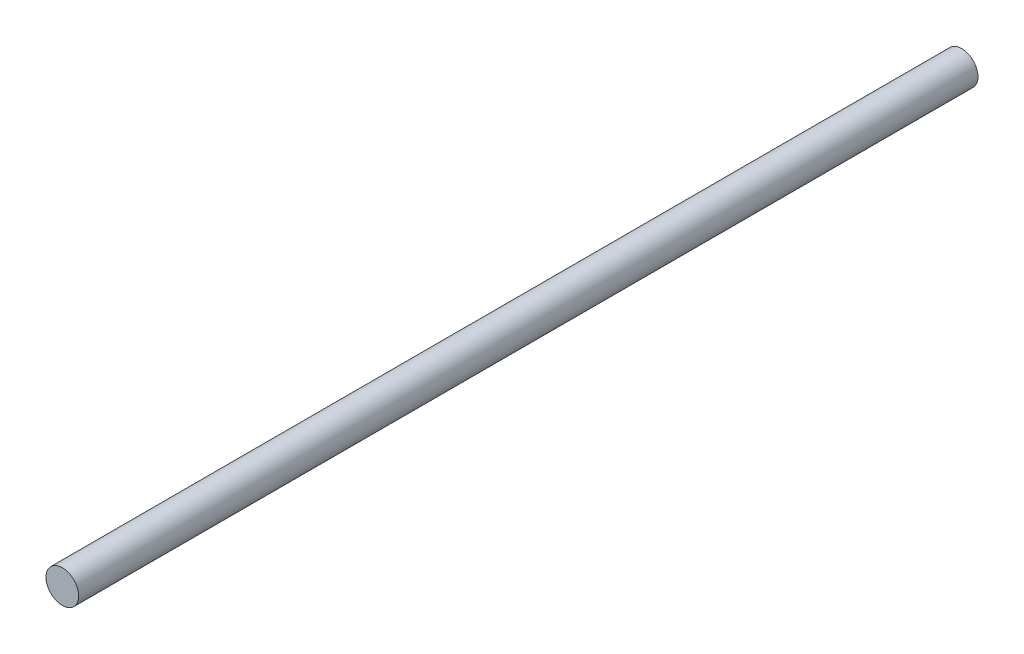
ISO-10303-21;
HEADER;
FILE_DESCRIPTION(('STEP AP214'),'2;1');
FILE_NAME('part.step','',(''),(''),'','','');
FILE_SCHEMA(('AUTOMOTIVE_DESIGN { 1 0 10303 214 1 1 1 1 }'));
ENDSEC;
DATA;
#1=APPLICATION_CONTEXT('core data for automotive mechanical design processes');
#2=APPLICATION_PROTOCOL_DEFINITION('international standard','automotive_design',2000,#1);
#3=PRODUCT_CONTEXT('',#1,'mechanical');
#4=PRODUCT('Part','Part','',(#3));
#5=PRODUCT_RELATED_PRODUCT_CATEGORY('part','',(#4));
#6=PRODUCT_DEFINITION_FORMATION('','',#4);
#7=PRODUCT_DEFINITION_CONTEXT('part definition',#1,'design');
#8=PRODUCT_DEFINITION('design','',#6,#7);
#9=PRODUCT_DEFINITION_SHAPE('','',#8);
#10=(LENGTH_UNIT() NAMED_UNIT(*) SI_UNIT(.MILLI.,.METRE.));
#11=(NAMED_UNIT(*) PLANE_ANGLE_UNIT() SI_UNIT($,.RADIAN.));
#12=(NAMED_UNIT(*) SI_UNIT($,.STERADIAN.) SOLID_ANGLE_UNIT());
#13=UNCERTAINTY_MEASURE_WITH_UNIT(LENGTH_MEASURE(1.E-05),#10,'distance_accuracy_value','');
#14=(GEOMETRIC_REPRESENTATION_CONTEXT(3) GLOBAL_UNCERTAINTY_ASSIGNED_CONTEXT((#13)) GLOBAL_UNIT_ASSIGNED_CONTEXT((#10,
#11,#12)) REPRESENTATION_CONTEXT('',''));
#15=CARTESIAN_POINT('',(0.,0.,0.));
#16=DIRECTION('',(0.,0.,1.));
#17=DIRECTION('',(1.,0.,0.));
#18=AXIS2_PLACEMENT_3D('',#15,#16,#17);
#19=CARTESIAN_POINT('',(0.,0.,44.));
#20=DIRECTION('',(0.,0.,-1.));
#21=DIRECTION('',(-1.,0.,0.));
#22=AXIS2_PLACEMENT_3D('',#19,#20,#21);
#23=CYLINDRICAL_SURFACE('',#22,0.8);
#24=CARTESIAN_POINT('',(0.,0.,44.));
#25=DIRECTION('',(0.,0.,1.));
#26=DIRECTION('',(1.,0.,0.));
#27=AXIS2_PLACEMENT_3D('',#24,#25,#26);
#28=CIRCLE('',#27,0.8);
#29=CARTESIAN_POINT('',(0.8,0.,44.));
#30=VERTEX_POINT('',#29);
#31=EDGE_CURVE('E10',#30,#30,#28,.T.);
#32=ORIENTED_EDGE('',*,*,#31,.F.);
#33=EDGE_LOOP('',(#32));
#34=FACE_BOUND('',#33,.T.);
#35=CARTESIAN_POINT('',(0.,0.,0.));
#36=DIRECTION('',(0.,0.,1.));
#37=DIRECTION('',(1.,0.,0.));
#38=AXIS2_PLACEMENT_3D('',#35,#36,#37);
#39=CIRCLE('',#38,0.8);
#40=CARTESIAN_POINT('',(0.8,0.,0.));
#41=VERTEX_POINT('',#40);
#42=EDGE_CURVE('E36',#41,#41,#39,.T.);
#43=ORIENTED_EDGE('',*,*,#42,.T.);
#44=EDGE_LOOP('',(#43));
#45=FACE_BOUND('',#44,.T.);
#46=ADVANCED_FACE('F33',(#34,#45),#23,.T.);
#47=CARTESIAN_POINT('',(0.,0.,44.));
#48=DIRECTION('',(0.,0.,1.));
#49=DIRECTION('',(1.,0.,0.));
#50=AXIS2_PLACEMENT_3D('',#47,#48,#49);
#51=PLANE('',#50);
#52=ORIENTED_EDGE('',*,*,#31,.T.);
#53=EDGE_LOOP('',(#52));
#54=FACE_BOUND('',#53,.T.);
#55=ADVANCED_FACE('F48',(#54),#51,.T.);
#56=CARTESIAN_POINT('',(0.,0.,0.));
#57=DIRECTION('',(0.,0.,1.));
#58=DIRECTION('',(1.,0.,0.));
#59=AXIS2_PLACEMENT_3D('',#56,#57,#58);
#60=PLANE('',#59);
#61=ORIENTED_EDGE('',*,*,#42,.F.);
#62=EDGE_LOOP('',(#61));
#63=FACE_BOUND('',#62,.T.);
#64=ADVANCED_FACE('F46',(#63),#60,.F.);
#65=CLOSED_SHELL('',(#46,#55,#64));
#66=MANIFOLD_SOLID_BREP('B2',#65);
#67=ADVANCED_BREP_SHAPE_REPRESENTATION('',(#18,#66),#14);
#68=SHAPE_DEFINITION_REPRESENTATION(#9,#67);
ENDSEC;
END-ISO-10303-21;
